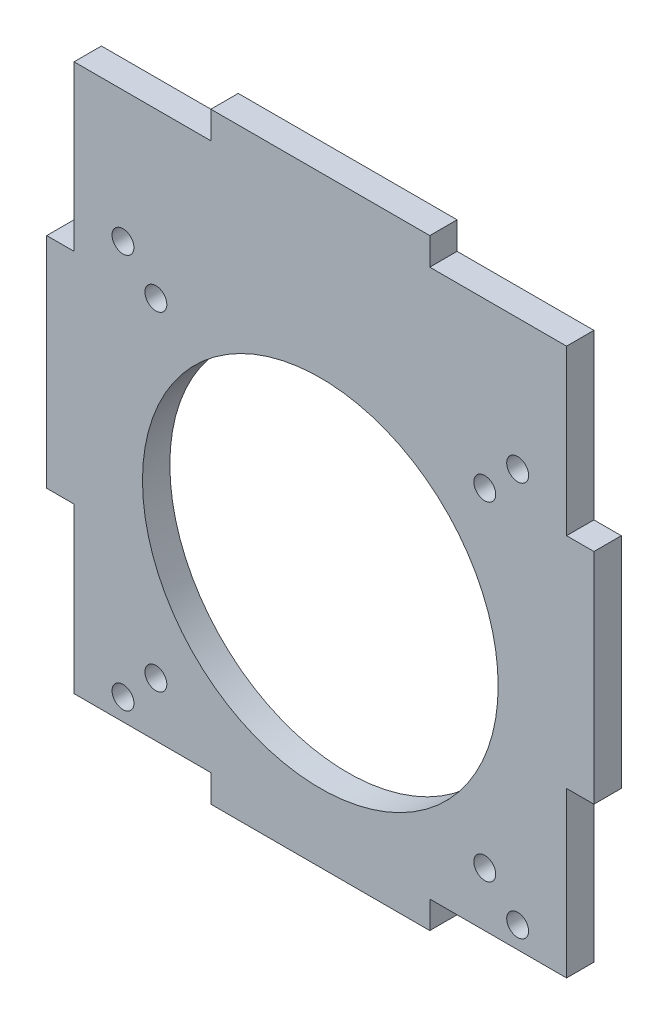
ISO-10303-21;
HEADER;
FILE_DESCRIPTION(('STEP AP214'),'2;1');
FILE_NAME('part.step','',(''),(''),'','','');
FILE_SCHEMA(('AUTOMOTIVE_DESIGN { 1 0 10303 214 1 1 1 1 }'));
ENDSEC;
DATA;
#1=APPLICATION_CONTEXT('core data for automotive mechanical design processes');
#2=APPLICATION_PROTOCOL_DEFINITION('international standard','automotive_design',2000,#1);
#3=PRODUCT_CONTEXT('',#1,'mechanical');
#4=PRODUCT('Part','Part','',(#3));
#5=PRODUCT_RELATED_PRODUCT_CATEGORY('part','',(#4));
#6=PRODUCT_DEFINITION_FORMATION('','',#4);
#7=PRODUCT_DEFINITION_CONTEXT('part definition',#1,'design');
#8=PRODUCT_DEFINITION('design','',#6,#7);
#9=PRODUCT_DEFINITION_SHAPE('','',#8);
#10=(LENGTH_UNIT() NAMED_UNIT(*) SI_UNIT(.MILLI.,.METRE.));
#11=(NAMED_UNIT(*) PLANE_ANGLE_UNIT() SI_UNIT($,.RADIAN.));
#12=(NAMED_UNIT(*) SI_UNIT($,.STERADIAN.) SOLID_ANGLE_UNIT());
#13=UNCERTAINTY_MEASURE_WITH_UNIT(LENGTH_MEASURE(1.E-05),#10,'distance_accuracy_value','');
#14=(GEOMETRIC_REPRESENTATION_CONTEXT(3) GLOBAL_UNCERTAINTY_ASSIGNED_CONTEXT((#13)) GLOBAL_UNIT_ASSIGNED_CONTEXT((#10,
#11,#12)) REPRESENTATION_CONTEXT('',''));
#15=CARTESIAN_POINT('',(0.,0.,0.));
#16=DIRECTION('',(0.,0.,1.));
#17=DIRECTION('',(1.,0.,0.));
#18=AXIS2_PLACEMENT_3D('',#15,#16,#17);
#19=CARTESIAN_POINT('',(0.,0.,5.));
#20=DIRECTION('',(0.,0.,-1.));
#21=DIRECTION('',(-1.,0.,0.));
#22=AXIS2_PLACEMENT_3D('',#19,#20,#21);
#23=PLANE('',#22);
#24=DIRECTION('',(-1.,0.,0.));
#25=VECTOR('',#24,1.);
#26=CARTESIAN_POINT('',(-20.,60.,5.));
#27=LINE('',#26,#25);
#28=CARTESIAN_POINT('',(-20.,60.,5.));
#29=VERTEX_POINT('',#28);
#30=CARTESIAN_POINT('',(-45.,60.,5.));
#31=VERTEX_POINT('',#30);
#32=EDGE_CURVE('E241',#29,#31,#27,.T.);
#33=ORIENTED_EDGE('',*,*,#32,.T.);
#34=DIRECTION('',(0.,-1.,0.));
#35=VECTOR('',#34,1.);
#36=CARTESIAN_POINT('',(-45.,30.,5.));
#37=LINE('',#36,#35);
#38=CARTESIAN_POINT('',(-45.,30.,5.));
#39=VERTEX_POINT('',#38);
#40=EDGE_CURVE('E129',#31,#39,#37,.T.);
#41=ORIENTED_EDGE('',*,*,#40,.T.);
#42=DIRECTION('',(-1.,0.,0.));
#43=VECTOR('',#42,1.);
#44=CARTESIAN_POINT('',(-50.,30.,5.));
#45=LINE('',#44,#43);
#46=CARTESIAN_POINT('',(-50.,30.,5.));
#47=VERTEX_POINT('',#46);
#48=EDGE_CURVE('E292',#39,#47,#45,.T.);
#49=ORIENTED_EDGE('',*,*,#48,.T.);
#50=DIRECTION('',(0.,-1.,0.));
#51=VECTOR('',#50,1.);
#52=CARTESIAN_POINT('',(-50.,-10.,5.));
#53=LINE('',#52,#51);
#54=CARTESIAN_POINT('',(-50.,-10.,5.));
#55=VERTEX_POINT('',#54);
#56=EDGE_CURVE('E311',#47,#55,#53,.T.);
#57=ORIENTED_EDGE('',*,*,#56,.T.);
#58=DIRECTION('',(1.,0.,0.));
#59=VECTOR('',#58,1.);
#60=CARTESIAN_POINT('',(-50.,-10.,5.));
#61=LINE('',#60,#59);
#62=CARTESIAN_POINT('',(-45.,-10.,5.));
#63=VERTEX_POINT('',#62);
#64=EDGE_CURVE('E308',#55,#63,#61,.T.);
#65=ORIENTED_EDGE('',*,*,#64,.T.);
#66=DIRECTION('',(0.,-1.,0.));
#67=VECTOR('',#66,1.);
#68=CARTESIAN_POINT('',(-45.,-40.,5.));
#69=LINE('',#68,#67);
#70=CARTESIAN_POINT('',(-45.,-40.,5.));
#71=VERTEX_POINT('',#70);
#72=EDGE_CURVE('E310',#63,#71,#69,.T.);
#73=ORIENTED_EDGE('',*,*,#72,.T.);
#74=DIRECTION('',(1.,0.,0.));
#75=VECTOR('',#74,1.);
#76=CARTESIAN_POINT('',(-20.,-40.,5.));
#77=LINE('',#76,#75);
#78=CARTESIAN_POINT('',(-20.,-40.,5.));
#79=VERTEX_POINT('',#78);
#80=EDGE_CURVE('E313',#71,#79,#77,.T.);
#81=ORIENTED_EDGE('',*,*,#80,.T.);
#82=DIRECTION('',(0.,-1.,0.));
#83=VECTOR('',#82,1.);
#84=CARTESIAN_POINT('',(-20.,-40.,5.));
#85=LINE('',#84,#83);
#86=CARTESIAN_POINT('',(-20.,-45.,5.));
#87=VERTEX_POINT('',#86);
#88=EDGE_CURVE('E319',#79,#87,#85,.T.);
#89=ORIENTED_EDGE('',*,*,#88,.T.);
#90=DIRECTION('',(1.,0.,0.));
#91=VECTOR('',#90,1.);
#92=CARTESIAN_POINT('',(20.,-45.,5.));
#93=LINE('',#92,#91);
#94=CARTESIAN_POINT('',(20.,-45.,5.));
#95=VERTEX_POINT('',#94);
#96=EDGE_CURVE('E321',#87,#95,#93,.T.);
#97=ORIENTED_EDGE('',*,*,#96,.T.);
#98=DIRECTION('',(0.,1.,0.));
#99=VECTOR('',#98,1.);
#100=CARTESIAN_POINT('',(20.,-40.,5.));
#101=LINE('',#100,#99);
#102=CARTESIAN_POINT('',(20.,-40.,5.));
#103=VERTEX_POINT('',#102);
#104=EDGE_CURVE('E323',#95,#103,#101,.T.);
#105=ORIENTED_EDGE('',*,*,#104,.T.);
#106=DIRECTION('',(1.,0.,0.));
#107=VECTOR('',#106,1.);
#108=CARTESIAN_POINT('',(45.,-40.,5.));
#109=LINE('',#108,#107);
#110=CARTESIAN_POINT('',(45.,-40.,5.));
#111=VERTEX_POINT('',#110);
#112=EDGE_CURVE('E325',#103,#111,#109,.T.);
#113=ORIENTED_EDGE('',*,*,#112,.T.);
#114=DIRECTION('',(0.,1.,0.));
#115=VECTOR('',#114,1.);
#116=CARTESIAN_POINT('',(45.,-40.,5.));
#117=LINE('',#116,#115);
#118=CARTESIAN_POINT('',(45.,-10.,5.));
#119=VERTEX_POINT('',#118);
#120=EDGE_CURVE('E327',#111,#119,#117,.T.);
#121=ORIENTED_EDGE('',*,*,#120,.T.);
#122=DIRECTION('',(1.,0.,0.));
#123=VECTOR('',#122,1.);
#124=CARTESIAN_POINT('',(45.,-10.,5.));
#125=LINE('',#124,#123);
#126=CARTESIAN_POINT('',(50.,-10.,5.));
#127=VERTEX_POINT('',#126);
#128=EDGE_CURVE('E329',#119,#127,#125,.T.);
#129=ORIENTED_EDGE('',*,*,#128,.T.);
#130=DIRECTION('',(0.,1.,0.));
#131=VECTOR('',#130,1.);
#132=CARTESIAN_POINT('',(50.,-10.,5.));
#133=LINE('',#132,#131);
#134=CARTESIAN_POINT('',(50.,30.,5.));
#135=VERTEX_POINT('',#134);
#136=EDGE_CURVE('E331',#127,#135,#133,.T.);
#137=ORIENTED_EDGE('',*,*,#136,.T.);
#138=DIRECTION('',(-1.,0.,0.));
#139=VECTOR('',#138,1.);
#140=CARTESIAN_POINT('',(45.,30.,5.));
#141=LINE('',#140,#139);
#142=CARTESIAN_POINT('',(45.,30.,5.));
#143=VERTEX_POINT('',#142);
#144=EDGE_CURVE('E333',#135,#143,#141,.T.);
#145=ORIENTED_EDGE('',*,*,#144,.T.);
#146=DIRECTION('',(0.,1.,0.));
#147=VECTOR('',#146,1.);
#148=CARTESIAN_POINT('',(45.,30.,5.));
#149=LINE('',#148,#147);
#150=CARTESIAN_POINT('',(45.,60.,5.));
#151=VERTEX_POINT('',#150);
#152=EDGE_CURVE('E335',#143,#151,#149,.T.);
#153=ORIENTED_EDGE('',*,*,#152,.T.);
#154=DIRECTION('',(-1.,0.,0.));
#155=VECTOR('',#154,1.);
#156=CARTESIAN_POINT('',(45.,60.,5.));
#157=LINE('',#156,#155);
#158=CARTESIAN_POINT('',(20.,60.,5.));
#159=VERTEX_POINT('',#158);
#160=EDGE_CURVE('E184',#151,#159,#157,.T.);
#161=ORIENTED_EDGE('',*,*,#160,.T.);
#162=DIRECTION('',(0.,1.,0.));
#163=VECTOR('',#162,1.);
#164=CARTESIAN_POINT('',(20.,65.,5.));
#165=LINE('',#164,#163);
#166=CARTESIAN_POINT('',(20.,65.,5.));
#167=VERTEX_POINT('',#166);
#168=EDGE_CURVE('E178',#159,#167,#165,.T.);
#169=ORIENTED_EDGE('',*,*,#168,.T.);
#170=DIRECTION('',(-1.,0.,0.));
#171=VECTOR('',#170,1.);
#172=CARTESIAN_POINT('',(20.,65.,5.));
#173=LINE('',#172,#171);
#174=CARTESIAN_POINT('',(-20.,65.,5.));
#175=VERTEX_POINT('',#174);
#176=EDGE_CURVE('E182',#167,#175,#173,.T.);
#177=ORIENTED_EDGE('',*,*,#176,.T.);
#178=DIRECTION('',(0.,-1.,0.));
#179=VECTOR('',#178,1.);
#180=CARTESIAN_POINT('',(-20.,65.,5.));
#181=LINE('',#180,#179);
#182=EDGE_CURVE('E50',#175,#29,#181,.T.);
#183=ORIENTED_EDGE('',*,*,#182,.T.);
#184=EDGE_LOOP('',(#33,#41,#49,#57,#65,#73,#81,#89,#97,#105,#113,#121,#129,#137,#145,#153,#161,
#169,#177,#183));
#185=FACE_BOUND('',#184,.T.);
#186=CARTESIAN_POINT('',(-36.06,36.06,5.));
#187=DIRECTION('',(0.,0.,1.));
#188=DIRECTION('',(1.,0.,0.));
#189=AXIS2_PLACEMENT_3D('',#186,#187,#188);
#190=CIRCLE('',#189,2.);
#191=CARTESIAN_POINT('',(-34.06,36.06,5.));
#192=VERTEX_POINT('',#191);
#193=EDGE_CURVE('E206',#192,#192,#190,.T.);
#194=ORIENTED_EDGE('',*,*,#193,.F.);
#195=EDGE_LOOP('',(#194));
#196=FACE_BOUND('',#195,.T.);
#197=CARTESIAN_POINT('',(36.06,36.06,5.));
#198=DIRECTION('',(0.,0.,1.));
#199=DIRECTION('',(1.,0.,0.));
#200=AXIS2_PLACEMENT_3D('',#197,#198,#199);
#201=CIRCLE('',#200,2.);
#202=CARTESIAN_POINT('',(38.06,36.06,5.));
#203=VERTEX_POINT('',#202);
#204=EDGE_CURVE('E449',#203,#203,#201,.T.);
#205=ORIENTED_EDGE('',*,*,#204,.F.);
#206=EDGE_LOOP('',(#205));
#207=FACE_BOUND('',#206,.T.);
#208=CARTESIAN_POINT('',(36.0600000000007,-36.06,5.));
#209=DIRECTION('',(0.,0.,1.));
#210=DIRECTION('',(1.,0.,0.));
#211=AXIS2_PLACEMENT_3D('',#208,#209,#210);
#212=CIRCLE('',#211,2.);
#213=CARTESIAN_POINT('',(38.0600000000008,-36.06,5.));
#214=VERTEX_POINT('',#213);
#215=EDGE_CURVE('E443',#214,#214,#212,.T.);
#216=ORIENTED_EDGE('',*,*,#215,.F.);
#217=EDGE_LOOP('',(#216));
#218=FACE_BOUND('',#217,.T.);
#219=CARTESIAN_POINT('',(-36.0599999999992,-36.06,5.));
#220=DIRECTION('',(0.,0.,1.));
#221=DIRECTION('',(1.,0.,0.));
#222=AXIS2_PLACEMENT_3D('',#219,#220,#221);
#223=CIRCLE('',#222,2.);
#224=CARTESIAN_POINT('',(-34.0599999999992,-36.06,5.));
#225=VERTEX_POINT('',#224);
#226=EDGE_CURVE('E437',#225,#225,#223,.T.);
#227=ORIENTED_EDGE('',*,*,#226,.F.);
#228=EDGE_LOOP('',(#227));
#229=FACE_BOUND('',#228,.T.);
#230=CARTESIAN_POINT('',(0.,0.,5.));
#231=DIRECTION('',(0.,0.,1.));
#232=DIRECTION('',(1.,0.,0.));
#233=AXIS2_PLACEMENT_3D('',#230,#231,#232);
#234=CIRCLE('',#233,32.5);
#235=CARTESIAN_POINT('',(32.5,0.,5.));
#236=VERTEX_POINT('',#235);
#237=EDGE_CURVE('E431',#236,#236,#234,.T.);
#238=ORIENTED_EDGE('',*,*,#237,.F.);
#239=EDGE_LOOP('',(#238));
#240=FACE_BOUND('',#239,.T.);
#241=CARTESIAN_POINT('',(-30.0520382004283,30.0520382004283,5.));
#242=DIRECTION('',(0.,0.,1.));
#243=DIRECTION('',(1.,0.,0.));
#244=AXIS2_PLACEMENT_3D('',#241,#242,#243);
#245=CIRCLE('',#244,2.);
#246=CARTESIAN_POINT('',(-28.0520382004283,30.0520382004283,5.));
#247=VERTEX_POINT('',#246);
#248=EDGE_CURVE('E425',#247,#247,#245,.T.);
#249=ORIENTED_EDGE('',*,*,#248,.F.);
#250=EDGE_LOOP('',(#249));
#251=FACE_BOUND('',#250,.T.);
#252=CARTESIAN_POINT('',(30.0520382004284,30.0520382004282,5.));
#253=DIRECTION('',(0.,0.,1.));
#254=DIRECTION('',(1.,0.,0.));
#255=AXIS2_PLACEMENT_3D('',#252,#253,#254);
#256=CIRCLE('',#255,2.);
#257=CARTESIAN_POINT('',(32.0520382004284,30.0520382004282,5.));
#258=VERTEX_POINT('',#257);
#259=EDGE_CURVE('E419',#258,#258,#256,.T.);
#260=ORIENTED_EDGE('',*,*,#259,.F.);
#261=EDGE_LOOP('',(#260));
#262=FACE_BOUND('',#261,.T.);
#263=CARTESIAN_POINT('',(30.05203820043,-30.05203820043,5.));
#264=DIRECTION('',(0.,0.,1.));
#265=DIRECTION('',(1.,0.,0.));
#266=AXIS2_PLACEMENT_3D('',#263,#264,#265);
#267=CIRCLE('',#266,2.00000000000139);
#268=CARTESIAN_POINT('',(32.0520382004314,-30.05203820043,5.));
#269=VERTEX_POINT('',#268);
#270=EDGE_CURVE('E413',#269,#269,#267,.T.);
#271=ORIENTED_EDGE('',*,*,#270,.F.);
#272=EDGE_LOOP('',(#271));
#273=FACE_BOUND('',#272,.T.);
#274=CARTESIAN_POINT('',(-30.0520382004283,-30.05203820043,5.));
#275=DIRECTION('',(0.,0.,1.));
#276=DIRECTION('',(1.,0.,0.));
#277=AXIS2_PLACEMENT_3D('',#274,#275,#276);
#278=CIRCLE('',#277,2.00000000000203);
#279=CARTESIAN_POINT('',(-28.0520382004262,-30.05203820043,5.));
#280=VERTEX_POINT('',#279);
#281=EDGE_CURVE('E404',#280,#280,#278,.T.);
#282=ORIENTED_EDGE('',*,*,#281,.F.);
#283=EDGE_LOOP('',(#282));
#284=FACE_BOUND('',#283,.T.);
#285=ADVANCED_FACE('F33',(#185,#196,#207,#218,#229,#240,#251,#262,#273,#284),#23,.F.);
#286=CARTESIAN_POINT('',(0.,0.,0.));
#287=DIRECTION('',(0.,0.,-1.));
#288=DIRECTION('',(-1.,0.,0.));
#289=AXIS2_PLACEMENT_3D('',#286,#287,#288);
#290=PLANE('',#289);
#291=CARTESIAN_POINT('',(30.05203820043,-30.05203820043,0.));
#292=DIRECTION('',(0.,0.,1.));
#293=DIRECTION('',(1.,0.,0.));
#294=AXIS2_PLACEMENT_3D('',#291,#292,#293);
#295=CIRCLE('',#294,2.00000000000139);
#296=CARTESIAN_POINT('',(32.0520382004314,-30.05203820043,0.));
#297=VERTEX_POINT('',#296);
#298=EDGE_CURVE('E410',#297,#297,#295,.T.);
#299=ORIENTED_EDGE('',*,*,#298,.T.);
#300=EDGE_LOOP('',(#299));
#301=FACE_BOUND('',#300,.T.);
#302=CARTESIAN_POINT('',(-30.0520382004283,30.0520382004283,0.));
#303=DIRECTION('',(0.,0.,1.));
#304=DIRECTION('',(1.,0.,0.));
#305=AXIS2_PLACEMENT_3D('',#302,#303,#304);
#306=CIRCLE('',#305,2.);
#307=CARTESIAN_POINT('',(-28.0520382004283,30.0520382004283,0.));
#308=VERTEX_POINT('',#307);
#309=EDGE_CURVE('E422',#308,#308,#306,.T.);
#310=ORIENTED_EDGE('',*,*,#309,.T.);
#311=EDGE_LOOP('',(#310));
#312=FACE_BOUND('',#311,.T.);
#313=CARTESIAN_POINT('',(-36.0599999999992,-36.06,0.));
#314=DIRECTION('',(0.,0.,1.));
#315=DIRECTION('',(1.,0.,0.));
#316=AXIS2_PLACEMENT_3D('',#313,#314,#315);
#317=CIRCLE('',#316,2.);
#318=CARTESIAN_POINT('',(-34.0599999999992,-36.06,0.));
#319=VERTEX_POINT('',#318);
#320=EDGE_CURVE('E434',#319,#319,#317,.T.);
#321=ORIENTED_EDGE('',*,*,#320,.T.);
#322=EDGE_LOOP('',(#321));
#323=FACE_BOUND('',#322,.T.);
#324=CARTESIAN_POINT('',(36.06,36.06,0.));
#325=DIRECTION('',(0.,0.,1.));
#326=DIRECTION('',(1.,0.,0.));
#327=AXIS2_PLACEMENT_3D('',#324,#325,#326);
#328=CIRCLE('',#327,2.);
#329=CARTESIAN_POINT('',(38.06,36.06,0.));
#330=VERTEX_POINT('',#329);
#331=EDGE_CURVE('E446',#330,#330,#328,.T.);
#332=ORIENTED_EDGE('',*,*,#331,.T.);
#333=EDGE_LOOP('',(#332));
#334=FACE_BOUND('',#333,.T.);
#335=DIRECTION('',(-1.,0.,0.));
#336=VECTOR('',#335,1.);
#337=CARTESIAN_POINT('',(-20.,60.,0.));
#338=LINE('',#337,#336);
#339=CARTESIAN_POINT('',(-20.,60.,0.));
#340=VERTEX_POINT('',#339);
#341=CARTESIAN_POINT('',(-45.,60.,0.));
#342=VERTEX_POINT('',#341);
#343=EDGE_CURVE('E202',#340,#342,#338,.T.);
#344=ORIENTED_EDGE('',*,*,#343,.F.);
#345=DIRECTION('',(0.,-1.,0.));
#346=VECTOR('',#345,1.);
#347=CARTESIAN_POINT('',(-20.,65.,0.));
#348=LINE('',#347,#346);
#349=CARTESIAN_POINT('',(-20.,65.,0.));
#350=VERTEX_POINT('',#349);
#351=EDGE_CURVE('E121',#350,#340,#348,.T.);
#352=ORIENTED_EDGE('',*,*,#351,.F.);
#353=DIRECTION('',(-1.,0.,0.));
#354=VECTOR('',#353,1.);
#355=CARTESIAN_POINT('',(20.,65.,0.));
#356=LINE('',#355,#354);
#357=CARTESIAN_POINT('',(20.,65.,0.));
#358=VERTEX_POINT('',#357);
#359=EDGE_CURVE('E115',#358,#350,#356,.T.);
#360=ORIENTED_EDGE('',*,*,#359,.F.);
#361=DIRECTION('',(0.,1.,0.));
#362=VECTOR('',#361,1.);
#363=CARTESIAN_POINT('',(20.,65.,0.));
#364=LINE('',#363,#362);
#365=CARTESIAN_POINT('',(20.,60.,0.));
#366=VERTEX_POINT('',#365);
#367=EDGE_CURVE('E192',#366,#358,#364,.T.);
#368=ORIENTED_EDGE('',*,*,#367,.F.);
#369=DIRECTION('',(-1.,0.,0.));
#370=VECTOR('',#369,1.);
#371=CARTESIAN_POINT('',(45.,60.,0.));
#372=LINE('',#371,#370);
#373=CARTESIAN_POINT('',(45.,60.,0.));
#374=VERTEX_POINT('',#373);
#375=EDGE_CURVE('E236',#374,#366,#372,.T.);
#376=ORIENTED_EDGE('',*,*,#375,.F.);
#377=DIRECTION('',(0.,1.,0.));
#378=VECTOR('',#377,1.);
#379=CARTESIAN_POINT('',(45.,30.,0.));
#380=LINE('',#379,#378);
#381=CARTESIAN_POINT('',(45.,30.,0.));
#382=VERTEX_POINT('',#381);
#383=EDGE_CURVE('E234',#382,#374,#380,.T.);
#384=ORIENTED_EDGE('',*,*,#383,.F.);
#385=DIRECTION('',(-1.,0.,0.));
#386=VECTOR('',#385,1.);
#387=CARTESIAN_POINT('',(45.,30.,0.));
#388=LINE('',#387,#386);
#389=CARTESIAN_POINT('',(50.,30.,0.));
#390=VERTEX_POINT('',#389);
#391=EDGE_CURVE('E232',#390,#382,#388,.T.);
#392=ORIENTED_EDGE('',*,*,#391,.F.);
#393=DIRECTION('',(0.,1.,0.));
#394=VECTOR('',#393,1.);
#395=CARTESIAN_POINT('',(50.,-10.,0.));
#396=LINE('',#395,#394);
#397=CARTESIAN_POINT('',(50.,-10.,0.));
#398=VERTEX_POINT('',#397);
#399=EDGE_CURVE('E230',#398,#390,#396,.T.);
#400=ORIENTED_EDGE('',*,*,#399,.F.);
#401=DIRECTION('',(1.,0.,0.));
#402=VECTOR('',#401,1.);
#403=CARTESIAN_POINT('',(45.,-10.,0.));
#404=LINE('',#403,#402);
#405=CARTESIAN_POINT('',(45.,-10.,0.));
#406=VERTEX_POINT('',#405);
#407=EDGE_CURVE('E228',#406,#398,#404,.T.);
#408=ORIENTED_EDGE('',*,*,#407,.F.);
#409=DIRECTION('',(0.,1.,0.));
#410=VECTOR('',#409,1.);
#411=CARTESIAN_POINT('',(45.,-40.,0.));
#412=LINE('',#411,#410);
#413=CARTESIAN_POINT('',(45.,-40.,0.));
#414=VERTEX_POINT('',#413);
#415=EDGE_CURVE('E226',#414,#406,#412,.T.);
#416=ORIENTED_EDGE('',*,*,#415,.F.);
#417=DIRECTION('',(1.,0.,0.));
#418=VECTOR('',#417,1.);
#419=CARTESIAN_POINT('',(45.,-40.,0.));
#420=LINE('',#419,#418);
#421=CARTESIAN_POINT('',(20.,-40.,0.));
#422=VERTEX_POINT('',#421);
#423=EDGE_CURVE('E224',#422,#414,#420,.T.);
#424=ORIENTED_EDGE('',*,*,#423,.F.);
#425=DIRECTION('',(0.,1.,0.));
#426=VECTOR('',#425,1.);
#427=CARTESIAN_POINT('',(20.,-40.,0.));
#428=LINE('',#427,#426);
#429=CARTESIAN_POINT('',(20.,-45.,0.));
#430=VERTEX_POINT('',#429);
#431=EDGE_CURVE('E222',#430,#422,#428,.T.);
#432=ORIENTED_EDGE('',*,*,#431,.F.);
#433=DIRECTION('',(1.,0.,0.));
#434=VECTOR('',#433,1.);
#435=CARTESIAN_POINT('',(20.,-45.,0.));
#436=LINE('',#435,#434);
#437=CARTESIAN_POINT('',(-20.,-45.,0.));
#438=VERTEX_POINT('',#437);
#439=EDGE_CURVE('E220',#438,#430,#436,.T.);
#440=ORIENTED_EDGE('',*,*,#439,.F.);
#441=DIRECTION('',(0.,-1.,0.));
#442=VECTOR('',#441,1.);
#443=CARTESIAN_POINT('',(-20.,-40.,0.));
#444=LINE('',#443,#442);
#445=CARTESIAN_POINT('',(-20.,-40.,0.));
#446=VERTEX_POINT('',#445);
#447=EDGE_CURVE('E218',#446,#438,#444,.T.);
#448=ORIENTED_EDGE('',*,*,#447,.F.);
#449=DIRECTION('',(1.,0.,0.));
#450=VECTOR('',#449,1.);
#451=CARTESIAN_POINT('',(-20.,-40.,0.));
#452=LINE('',#451,#450);
#453=CARTESIAN_POINT('',(-45.,-40.,0.));
#454=VERTEX_POINT('',#453);
#455=EDGE_CURVE('E216',#454,#446,#452,.T.);
#456=ORIENTED_EDGE('',*,*,#455,.F.);
#457=DIRECTION('',(0.,-1.,0.));
#458=VECTOR('',#457,1.);
#459=CARTESIAN_POINT('',(-45.,-40.,0.));
#460=LINE('',#459,#458);
#461=CARTESIAN_POINT('',(-45.,-10.,0.));
#462=VERTEX_POINT('',#461);
#463=EDGE_CURVE('E214',#462,#454,#460,.T.);
#464=ORIENTED_EDGE('',*,*,#463,.F.);
#465=DIRECTION('',(1.,0.,0.));
#466=VECTOR('',#465,1.);
#467=CARTESIAN_POINT('',(-50.,-10.,0.));
#468=LINE('',#467,#466);
#469=CARTESIAN_POINT('',(-50.,-10.,0.));
#470=VERTEX_POINT('',#469);
#471=EDGE_CURVE('E212',#470,#462,#468,.T.);
#472=ORIENTED_EDGE('',*,*,#471,.F.);
#473=DIRECTION('',(0.,-1.,0.));
#474=VECTOR('',#473,1.);
#475=CARTESIAN_POINT('',(-50.,-10.,0.));
#476=LINE('',#475,#474);
#477=CARTESIAN_POINT('',(-50.,30.,0.));
#478=VERTEX_POINT('',#477);
#479=EDGE_CURVE('E210',#478,#470,#476,.T.);
#480=ORIENTED_EDGE('',*,*,#479,.F.);
#481=DIRECTION('',(-1.,0.,0.));
#482=VECTOR('',#481,1.);
#483=CARTESIAN_POINT('',(-50.,30.,0.));
#484=LINE('',#483,#482);
#485=CARTESIAN_POINT('',(-45.,30.,0.));
#486=VERTEX_POINT('',#485);
#487=EDGE_CURVE('E208',#486,#478,#484,.T.);
#488=ORIENTED_EDGE('',*,*,#487,.F.);
#489=DIRECTION('',(0.,-1.,0.));
#490=VECTOR('',#489,1.);
#491=CARTESIAN_POINT('',(-45.,30.,0.));
#492=LINE('',#491,#490);
#493=EDGE_CURVE('E205',#342,#486,#492,.T.);
#494=ORIENTED_EDGE('',*,*,#493,.F.);
#495=EDGE_LOOP('',(#344,#352,#360,#368,#376,#384,#392,#400,#408,#416,#424,#432,#440,#448,#456,
#464,#472,#480,#488,#494));
#496=FACE_BOUND('',#495,.T.);
#497=CARTESIAN_POINT('',(-36.06,36.06,0.));
#498=DIRECTION('',(0.,0.,1.));
#499=DIRECTION('',(1.,0.,0.));
#500=AXIS2_PLACEMENT_3D('',#497,#498,#499);
#501=CIRCLE('',#500,2.);
#502=CARTESIAN_POINT('',(-34.06,36.06,0.));
#503=VERTEX_POINT('',#502);
#504=EDGE_CURVE('E452',#503,#503,#501,.T.);
#505=ORIENTED_EDGE('',*,*,#504,.T.);
#506=EDGE_LOOP('',(#505));
#507=FACE_BOUND('',#506,.T.);
#508=CARTESIAN_POINT('',(36.0600000000007,-36.06,0.));
#509=DIRECTION('',(0.,0.,1.));
#510=DIRECTION('',(1.,0.,0.));
#511=AXIS2_PLACEMENT_3D('',#508,#509,#510);
#512=CIRCLE('',#511,2.);
#513=CARTESIAN_POINT('',(38.0600000000008,-36.06,0.));
#514=VERTEX_POINT('',#513);
#515=EDGE_CURVE('E440',#514,#514,#512,.T.);
#516=ORIENTED_EDGE('',*,*,#515,.T.);
#517=EDGE_LOOP('',(#516));
#518=FACE_BOUND('',#517,.T.);
#519=CARTESIAN_POINT('',(0.,0.,0.));
#520=DIRECTION('',(0.,0.,1.));
#521=DIRECTION('',(1.,0.,0.));
#522=AXIS2_PLACEMENT_3D('',#519,#520,#521);
#523=CIRCLE('',#522,32.5);
#524=CARTESIAN_POINT('',(32.5,0.,0.));
#525=VERTEX_POINT('',#524);
#526=EDGE_CURVE('E428',#525,#525,#523,.T.);
#527=ORIENTED_EDGE('',*,*,#526,.T.);
#528=EDGE_LOOP('',(#527));
#529=FACE_BOUND('',#528,.T.);
#530=CARTESIAN_POINT('',(30.0520382004284,30.0520382004282,0.));
#531=DIRECTION('',(0.,0.,1.));
#532=DIRECTION('',(1.,0.,0.));
#533=AXIS2_PLACEMENT_3D('',#530,#531,#532);
#534=CIRCLE('',#533,2.);
#535=CARTESIAN_POINT('',(32.0520382004284,30.0520382004282,0.));
#536=VERTEX_POINT('',#535);
#537=EDGE_CURVE('E416',#536,#536,#534,.T.);
#538=ORIENTED_EDGE('',*,*,#537,.T.);
#539=EDGE_LOOP('',(#538));
#540=FACE_BOUND('',#539,.T.);
#541=CARTESIAN_POINT('',(-30.0520382004283,-30.05203820043,0.));
#542=DIRECTION('',(0.,0.,1.));
#543=DIRECTION('',(1.,0.,0.));
#544=AXIS2_PLACEMENT_3D('',#541,#542,#543);
#545=CIRCLE('',#544,2.00000000000203);
#546=CARTESIAN_POINT('',(-28.0520382004262,-30.05203820043,0.));
#547=VERTEX_POINT('',#546);
#548=EDGE_CURVE('E407',#547,#547,#545,.T.);
#549=ORIENTED_EDGE('',*,*,#548,.T.);
#550=EDGE_LOOP('',(#549));
#551=FACE_BOUND('',#550,.T.);
#552=ADVANCED_FACE('F296',(#301,#312,#323,#334,#496,#507,#518,#529,#540,#551),#290,.T.);
#553=CARTESIAN_POINT('',(-20.,60.,5.));
#554=DIRECTION('',(0.,-1.,0.));
#555=DIRECTION('',(1.,0.,0.));
#556=AXIS2_PLACEMENT_3D('',#553,#554,#555);
#557=PLANE('',#556);
#558=ORIENTED_EDGE('',*,*,#343,.T.);
#559=DIRECTION('',(0.,0.,-1.));
#560=VECTOR('',#559,1.);
#561=CARTESIAN_POINT('',(-45.,60.,5.));
#562=LINE('',#561,#560);
#563=EDGE_CURVE('E11',#31,#342,#562,.T.);
#564=ORIENTED_EDGE('',*,*,#563,.F.);
#565=ORIENTED_EDGE('',*,*,#32,.F.);
#566=DIRECTION('',(0.,0.,-1.));
#567=VECTOR('',#566,1.);
#568=CARTESIAN_POINT('',(-20.,60.,5.));
#569=LINE('',#568,#567);
#570=EDGE_CURVE('E198',#29,#340,#569,.T.);
#571=ORIENTED_EDGE('',*,*,#570,.T.);
#572=EDGE_LOOP('',(#558,#564,#565,#571));
#573=FACE_BOUND('',#572,.T.);
#574=ADVANCED_FACE('F35',(#573),#557,.F.);
#575=CARTESIAN_POINT('',(-45.,30.,5.));
#576=DIRECTION('',(1.,0.,0.));
#577=DIRECTION('',(0.,0.,-1.));
#578=AXIS2_PLACEMENT_3D('',#575,#576,#577);
#579=PLANE('',#578);
#580=ORIENTED_EDGE('',*,*,#493,.T.);
#581=DIRECTION('',(0.,0.,-1.));
#582=VECTOR('',#581,1.);
#583=CARTESIAN_POINT('',(-45.,30.,5.));
#584=LINE('',#583,#582);
#585=EDGE_CURVE('E42',#39,#486,#584,.T.);
#586=ORIENTED_EDGE('',*,*,#585,.F.);
#587=ORIENTED_EDGE('',*,*,#40,.F.);
#588=ORIENTED_EDGE('',*,*,#563,.T.);
#589=EDGE_LOOP('',(#580,#586,#587,#588));
#590=FACE_BOUND('',#589,.T.);
#591=ADVANCED_FACE('F689',(#590),#579,.F.);
#592=CARTESIAN_POINT('',(-50.,30.,5.));
#593=DIRECTION('',(0.,-1.,0.));
#594=DIRECTION('',(1.,0.,0.));
#595=AXIS2_PLACEMENT_3D('',#592,#593,#594);
#596=PLANE('',#595);
#597=ORIENTED_EDGE('',*,*,#487,.T.);
#598=DIRECTION('',(0.,0.,-1.));
#599=VECTOR('',#598,1.);
#600=CARTESIAN_POINT('',(-50.,30.,5.));
#601=LINE('',#600,#599);
#602=EDGE_CURVE('E284',#47,#478,#601,.T.);
#603=ORIENTED_EDGE('',*,*,#602,.F.);
#604=ORIENTED_EDGE('',*,*,#48,.F.);
#605=ORIENTED_EDGE('',*,*,#585,.T.);
#606=EDGE_LOOP('',(#597,#603,#604,#605));
#607=FACE_BOUND('',#606,.T.);
#608=ADVANCED_FACE('F290',(#607),#596,.F.);
#609=CARTESIAN_POINT('',(-50.,-10.,5.));
#610=DIRECTION('',(1.,0.,0.));
#611=DIRECTION('',(0.,1.,0.));
#612=AXIS2_PLACEMENT_3D('',#609,#610,#611);
#613=PLANE('',#612);
#614=ORIENTED_EDGE('',*,*,#479,.T.);
#615=DIRECTION('',(0.,0.,-1.));
#616=VECTOR('',#615,1.);
#617=CARTESIAN_POINT('',(-50.,-10.,5.));
#618=LINE('',#617,#616);
#619=EDGE_CURVE('E281',#55,#470,#618,.T.);
#620=ORIENTED_EDGE('',*,*,#619,.F.);
#621=ORIENTED_EDGE('',*,*,#56,.F.);
#622=ORIENTED_EDGE('',*,*,#602,.T.);
#623=EDGE_LOOP('',(#614,#620,#621,#622));
#624=FACE_BOUND('',#623,.T.);
#625=ADVANCED_FACE('F302',(#624),#613,.F.);
#626=CARTESIAN_POINT('',(-50.,-10.,5.));
#627=DIRECTION('',(0.,1.,0.));
#628=DIRECTION('',(-1.,0.,0.));
#629=AXIS2_PLACEMENT_3D('',#626,#627,#628);
#630=PLANE('',#629);
#631=ORIENTED_EDGE('',*,*,#471,.T.);
#632=DIRECTION('',(0.,0.,-1.));
#633=VECTOR('',#632,1.);
#634=CARTESIAN_POINT('',(-45.,-10.,5.));
#635=LINE('',#634,#633);
#636=EDGE_CURVE('E278',#63,#462,#635,.T.);
#637=ORIENTED_EDGE('',*,*,#636,.F.);
#638=ORIENTED_EDGE('',*,*,#64,.F.);
#639=ORIENTED_EDGE('',*,*,#619,.T.);
#640=EDGE_LOOP('',(#631,#637,#638,#639));
#641=FACE_BOUND('',#640,.T.);
#642=ADVANCED_FACE('F306',(#641),#630,.F.);
#643=CARTESIAN_POINT('',(-45.,-40.,5.));
#644=DIRECTION('',(1.,0.,0.));
#645=DIRECTION('',(0.,0.,-1.));
#646=AXIS2_PLACEMENT_3D('',#643,#644,#645);
#647=PLANE('',#646);
#648=ORIENTED_EDGE('',*,*,#463,.T.);
#649=DIRECTION('',(0.,0.,-1.));
#650=VECTOR('',#649,1.);
#651=CARTESIAN_POINT('',(-45.,-40.,5.));
#652=LINE('',#651,#650);
#653=EDGE_CURVE('E275',#71,#454,#652,.T.);
#654=ORIENTED_EDGE('',*,*,#653,.F.);
#655=ORIENTED_EDGE('',*,*,#72,.F.);
#656=ORIENTED_EDGE('',*,*,#636,.T.);
#657=EDGE_LOOP('',(#648,#654,#655,#656));
#658=FACE_BOUND('',#657,.T.);
#659=ADVANCED_FACE('F654',(#658),#647,.F.);
#660=CARTESIAN_POINT('',(-20.,-40.,5.));
#661=DIRECTION('',(0.,1.,0.));
#662=DIRECTION('',(-1.,0.,0.));
#663=AXIS2_PLACEMENT_3D('',#660,#661,#662);
#664=PLANE('',#663);
#665=ORIENTED_EDGE('',*,*,#455,.T.);
#666=DIRECTION('',(0.,0.,-1.));
#667=VECTOR('',#666,1.);
#668=CARTESIAN_POINT('',(-20.,-40.,5.));
#669=LINE('',#668,#667);
#670=EDGE_CURVE('E272',#79,#446,#669,.T.);
#671=ORIENTED_EDGE('',*,*,#670,.F.);
#672=ORIENTED_EDGE('',*,*,#80,.F.);
#673=ORIENTED_EDGE('',*,*,#653,.T.);
#674=EDGE_LOOP('',(#665,#671,#672,#673));
#675=FACE_BOUND('',#674,.T.);
#676=ADVANCED_FACE('F644',(#675),#664,.F.);
#677=CARTESIAN_POINT('',(-20.,-40.,5.));
#678=DIRECTION('',(1.,0.,0.));
#679=DIRECTION('',(0.,1.,0.));
#680=AXIS2_PLACEMENT_3D('',#677,#678,#679);
#681=PLANE('',#680);
#682=ORIENTED_EDGE('',*,*,#447,.T.);
#683=DIRECTION('',(0.,0.,-1.));
#684=VECTOR('',#683,1.);
#685=CARTESIAN_POINT('',(-20.,-45.,5.));
#686=LINE('',#685,#684);
#687=EDGE_CURVE('E269',#87,#438,#686,.T.);
#688=ORIENTED_EDGE('',*,*,#687,.F.);
#689=ORIENTED_EDGE('',*,*,#88,.F.);
#690=ORIENTED_EDGE('',*,*,#670,.T.);
#691=EDGE_LOOP('',(#682,#688,#689,#690));
#692=FACE_BOUND('',#691,.T.);
#693=ADVANCED_FACE('F634',(#692),#681,.F.);
#694=CARTESIAN_POINT('',(20.,-45.,5.));
#695=DIRECTION('',(0.,1.,0.));
#696=DIRECTION('',(-1.,0.,0.));
#697=AXIS2_PLACEMENT_3D('',#694,#695,#696);
#698=PLANE('',#697);
#699=ORIENTED_EDGE('',*,*,#439,.T.);
#700=DIRECTION('',(0.,0.,-1.));
#701=VECTOR('',#700,1.);
#702=CARTESIAN_POINT('',(20.,-45.,5.));
#703=LINE('',#702,#701);
#704=EDGE_CURVE('E266',#95,#430,#703,.T.);
#705=ORIENTED_EDGE('',*,*,#704,.F.);
#706=ORIENTED_EDGE('',*,*,#96,.F.);
#707=ORIENTED_EDGE('',*,*,#687,.T.);
#708=EDGE_LOOP('',(#699,#705,#706,#707));
#709=FACE_BOUND('',#708,.T.);
#710=ADVANCED_FACE('F624',(#709),#698,.F.);
#711=CARTESIAN_POINT('',(20.,-40.,5.));
#712=DIRECTION('',(-1.,0.,0.));
#713=DIRECTION('',(0.,0.,1.));
#714=AXIS2_PLACEMENT_3D('',#711,#712,#713);
#715=PLANE('',#714);
#716=ORIENTED_EDGE('',*,*,#431,.T.);
#717=DIRECTION('',(0.,0.,-1.));
#718=VECTOR('',#717,1.);
#719=CARTESIAN_POINT('',(20.,-40.,5.));
#720=LINE('',#719,#718);
#721=EDGE_CURVE('E263',#103,#422,#720,.T.);
#722=ORIENTED_EDGE('',*,*,#721,.F.);
#723=ORIENTED_EDGE('',*,*,#104,.F.);
#724=ORIENTED_EDGE('',*,*,#704,.T.);
#725=EDGE_LOOP('',(#716,#722,#723,#724));
#726=FACE_BOUND('',#725,.T.);
#727=ADVANCED_FACE('F614',(#726),#715,.F.);
#728=CARTESIAN_POINT('',(45.,-40.,5.));
#729=DIRECTION('',(0.,1.,0.));
#730=DIRECTION('',(0.,0.,1.));
#731=AXIS2_PLACEMENT_3D('',#728,#729,#730);
#732=PLANE('',#731);
#733=ORIENTED_EDGE('',*,*,#423,.T.);
#734=DIRECTION('',(0.,0.,-1.));
#735=VECTOR('',#734,1.);
#736=CARTESIAN_POINT('',(45.,-40.,5.));
#737=LINE('',#736,#735);
#738=EDGE_CURVE('E260',#111,#414,#737,.T.);
#739=ORIENTED_EDGE('',*,*,#738,.F.);
#740=ORIENTED_EDGE('',*,*,#112,.F.);
#741=ORIENTED_EDGE('',*,*,#721,.T.);
#742=EDGE_LOOP('',(#733,#739,#740,#741));
#743=FACE_BOUND('',#742,.T.);
#744=ADVANCED_FACE('F604',(#743),#732,.F.);
#745=CARTESIAN_POINT('',(45.,-40.,5.));
#746=DIRECTION('',(-1.,0.,0.));
#747=DIRECTION('',(0.,0.,1.));
#748=AXIS2_PLACEMENT_3D('',#745,#746,#747);
#749=PLANE('',#748);
#750=ORIENTED_EDGE('',*,*,#415,.T.);
#751=DIRECTION('',(0.,0.,-1.));
#752=VECTOR('',#751,1.);
#753=CARTESIAN_POINT('',(45.,-10.,5.));
#754=LINE('',#753,#752);
#755=EDGE_CURVE('E257',#119,#406,#754,.T.);
#756=ORIENTED_EDGE('',*,*,#755,.F.);
#757=ORIENTED_EDGE('',*,*,#120,.F.);
#758=ORIENTED_EDGE('',*,*,#738,.T.);
#759=EDGE_LOOP('',(#750,#756,#757,#758));
#760=FACE_BOUND('',#759,.T.);
#761=ADVANCED_FACE('F594',(#760),#749,.F.);
#762=CARTESIAN_POINT('',(45.,-10.,5.));
#763=DIRECTION('',(0.,1.,0.));
#764=DIRECTION('',(-1.,0.,0.));
#765=AXIS2_PLACEMENT_3D('',#762,#763,#764);
#766=PLANE('',#765);
#767=ORIENTED_EDGE('',*,*,#407,.T.);
#768=DIRECTION('',(0.,0.,-1.));
#769=VECTOR('',#768,1.);
#770=CARTESIAN_POINT('',(50.,-10.,5.));
#771=LINE('',#770,#769);
#772=EDGE_CURVE('E254',#127,#398,#771,.T.);
#773=ORIENTED_EDGE('',*,*,#772,.F.);
#774=ORIENTED_EDGE('',*,*,#128,.F.);
#775=ORIENTED_EDGE('',*,*,#755,.T.);
#776=EDGE_LOOP('',(#767,#773,#774,#775));
#777=FACE_BOUND('',#776,.T.);
#778=ADVANCED_FACE('F584',(#777),#766,.F.);
#779=CARTESIAN_POINT('',(50.,-10.,5.));
#780=DIRECTION('',(-1.,0.,0.));
#781=DIRECTION('',(0.,-1.,0.));
#782=AXIS2_PLACEMENT_3D('',#779,#780,#781);
#783=PLANE('',#782);
#784=ORIENTED_EDGE('',*,*,#399,.T.);
#785=DIRECTION('',(0.,0.,-1.));
#786=VECTOR('',#785,1.);
#787=CARTESIAN_POINT('',(50.,30.,5.));
#788=LINE('',#787,#786);
#789=EDGE_CURVE('E251',#135,#390,#788,.T.);
#790=ORIENTED_EDGE('',*,*,#789,.F.);
#791=ORIENTED_EDGE('',*,*,#136,.F.);
#792=ORIENTED_EDGE('',*,*,#772,.T.);
#793=EDGE_LOOP('',(#784,#790,#791,#792));
#794=FACE_BOUND('',#793,.T.);
#795=ADVANCED_FACE('F574',(#794),#783,.F.);
#796=CARTESIAN_POINT('',(45.,30.,5.));
#797=DIRECTION('',(0.,-1.,0.));
#798=DIRECTION('',(0.,0.,-1.));
#799=AXIS2_PLACEMENT_3D('',#796,#797,#798);
#800=PLANE('',#799);
#801=ORIENTED_EDGE('',*,*,#391,.T.);
#802=DIRECTION('',(0.,0.,-1.));
#803=VECTOR('',#802,1.);
#804=CARTESIAN_POINT('',(45.,30.,5.));
#805=LINE('',#804,#803);
#806=EDGE_CURVE('E248',#143,#382,#805,.T.);
#807=ORIENTED_EDGE('',*,*,#806,.F.);
#808=ORIENTED_EDGE('',*,*,#144,.F.);
#809=ORIENTED_EDGE('',*,*,#789,.T.);
#810=EDGE_LOOP('',(#801,#807,#808,#809));
#811=FACE_BOUND('',#810,.T.);
#812=ADVANCED_FACE('F565',(#811),#800,.F.);
#813=CARTESIAN_POINT('',(45.,30.,5.));
#814=DIRECTION('',(-1.,0.,0.));
#815=DIRECTION('',(0.,0.,1.));
#816=AXIS2_PLACEMENT_3D('',#813,#814,#815);
#817=PLANE('',#816);
#818=ORIENTED_EDGE('',*,*,#383,.T.);
#819=DIRECTION('',(0.,0.,-1.));
#820=VECTOR('',#819,1.);
#821=CARTESIAN_POINT('',(45.,60.,5.));
#822=LINE('',#821,#820);
#823=EDGE_CURVE('E245',#151,#374,#822,.T.);
#824=ORIENTED_EDGE('',*,*,#823,.F.);
#825=ORIENTED_EDGE('',*,*,#152,.F.);
#826=ORIENTED_EDGE('',*,*,#806,.T.);
#827=EDGE_LOOP('',(#818,#824,#825,#826));
#828=FACE_BOUND('',#827,.T.);
#829=ADVANCED_FACE('F341',(#828),#817,.F.);
#830=CARTESIAN_POINT('',(45.,60.,5.));
#831=DIRECTION('',(0.,-1.,0.));
#832=DIRECTION('',(1.,0.,0.));
#833=AXIS2_PLACEMENT_3D('',#830,#831,#832);
#834=PLANE('',#833);
#835=ORIENTED_EDGE('',*,*,#375,.T.);
#836=DIRECTION('',(0.,0.,-1.));
#837=VECTOR('',#836,1.);
#838=CARTESIAN_POINT('',(20.,60.,5.));
#839=LINE('',#838,#837);
#840=EDGE_CURVE('E193',#159,#366,#839,.T.);
#841=ORIENTED_EDGE('',*,*,#840,.F.);
#842=ORIENTED_EDGE('',*,*,#160,.F.);
#843=ORIENTED_EDGE('',*,*,#823,.T.);
#844=EDGE_LOOP('',(#835,#841,#842,#843));
#845=FACE_BOUND('',#844,.T.);
#846=ADVANCED_FACE('F345',(#845),#834,.F.);
#847=CARTESIAN_POINT('',(20.,65.,5.));
#848=DIRECTION('',(-1.,0.,0.));
#849=DIRECTION('',(0.,-1.,0.));
#850=AXIS2_PLACEMENT_3D('',#847,#848,#849);
#851=PLANE('',#850);
#852=ORIENTED_EDGE('',*,*,#367,.T.);
#853=DIRECTION('',(0.,0.,-1.));
#854=VECTOR('',#853,1.);
#855=CARTESIAN_POINT('',(20.,65.,5.));
#856=LINE('',#855,#854);
#857=EDGE_CURVE('E189',#167,#358,#856,.T.);
#858=ORIENTED_EDGE('',*,*,#857,.F.);
#859=ORIENTED_EDGE('',*,*,#168,.F.);
#860=ORIENTED_EDGE('',*,*,#840,.T.);
#861=EDGE_LOOP('',(#852,#858,#859,#860));
#862=FACE_BOUND('',#861,.T.);
#863=ADVANCED_FACE('F190',(#862),#851,.F.);
#864=CARTESIAN_POINT('',(20.,65.,5.));
#865=DIRECTION('',(0.,-1.,0.));
#866=DIRECTION('',(0.,0.,-1.));
#867=AXIS2_PLACEMENT_3D('',#864,#865,#866);
#868=PLANE('',#867);
#869=ORIENTED_EDGE('',*,*,#359,.T.);
#870=DIRECTION('',(0.,0.,-1.));
#871=VECTOR('',#870,1.);
#872=CARTESIAN_POINT('',(-20.,65.,5.));
#873=LINE('',#872,#871);
#874=EDGE_CURVE('E194',#175,#350,#873,.T.);
#875=ORIENTED_EDGE('',*,*,#874,.F.);
#876=ORIENTED_EDGE('',*,*,#176,.F.);
#877=ORIENTED_EDGE('',*,*,#857,.T.);
#878=EDGE_LOOP('',(#869,#875,#876,#877));
#879=FACE_BOUND('',#878,.T.);
#880=ADVANCED_FACE('F196',(#879),#868,.F.);
#881=CARTESIAN_POINT('',(-20.,65.,5.));
#882=DIRECTION('',(1.,0.,0.));
#883=DIRECTION('',(0.,1.,0.));
#884=AXIS2_PLACEMENT_3D('',#881,#882,#883);
#885=PLANE('',#884);
#886=ORIENTED_EDGE('',*,*,#351,.T.);
#887=ORIENTED_EDGE('',*,*,#570,.F.);
#888=ORIENTED_EDGE('',*,*,#182,.F.);
#889=ORIENTED_EDGE('',*,*,#874,.T.);
#890=EDGE_LOOP('',(#886,#887,#888,#889));
#891=FACE_BOUND('',#890,.T.);
#892=ADVANCED_FACE('F349',(#891),#885,.F.);
#893=CARTESIAN_POINT('',(-36.06,36.06,5.));
#894=DIRECTION('',(0.,0.,-1.));
#895=DIRECTION('',(-1.,0.,0.));
#896=AXIS2_PLACEMENT_3D('',#893,#894,#895);
#897=CYLINDRICAL_SURFACE('',#896,2.);
#898=ORIENTED_EDGE('',*,*,#193,.T.);
#899=EDGE_LOOP('',(#898));
#900=FACE_BOUND('',#899,.T.);
#901=ORIENTED_EDGE('',*,*,#504,.F.);
#902=EDGE_LOOP('',(#901));
#903=FACE_BOUND('',#902,.T.);
#904=ADVANCED_FACE('F351',(#900,#903),#897,.F.);
#905=CARTESIAN_POINT('',(36.06,36.06,5.));
#906=DIRECTION('',(0.,0.,-1.));
#907=DIRECTION('',(-1.,0.,0.));
#908=AXIS2_PLACEMENT_3D('',#905,#906,#907);
#909=CYLINDRICAL_SURFACE('',#908,2.);
#910=ORIENTED_EDGE('',*,*,#204,.T.);
#911=EDGE_LOOP('',(#910));
#912=FACE_BOUND('',#911,.T.);
#913=ORIENTED_EDGE('',*,*,#331,.F.);
#914=EDGE_LOOP('',(#913));
#915=FACE_BOUND('',#914,.T.);
#916=ADVANCED_FACE('F357',(#912,#915),#909,.F.);
#917=CARTESIAN_POINT('',(36.0600000000007,-36.06,5.));
#918=DIRECTION('',(0.,0.,-1.));
#919=DIRECTION('',(-1.,0.,0.));
#920=AXIS2_PLACEMENT_3D('',#917,#918,#919);
#921=CYLINDRICAL_SURFACE('',#920,2.);
#922=ORIENTED_EDGE('',*,*,#215,.T.);
#923=EDGE_LOOP('',(#922));
#924=FACE_BOUND('',#923,.T.);
#925=ORIENTED_EDGE('',*,*,#515,.F.);
#926=EDGE_LOOP('',(#925));
#927=FACE_BOUND('',#926,.T.);
#928=ADVANCED_FACE('F371',(#924,#927),#921,.F.);
#929=CARTESIAN_POINT('',(-36.0599999999992,-36.06,5.));
#930=DIRECTION('',(0.,0.,-1.));
#931=DIRECTION('',(-1.,0.,0.));
#932=AXIS2_PLACEMENT_3D('',#929,#930,#931);
#933=CYLINDRICAL_SURFACE('',#932,2.);
#934=ORIENTED_EDGE('',*,*,#226,.T.);
#935=EDGE_LOOP('',(#934));
#936=FACE_BOUND('',#935,.T.);
#937=ORIENTED_EDGE('',*,*,#320,.F.);
#938=EDGE_LOOP('',(#937));
#939=FACE_BOUND('',#938,.T.);
#940=ADVANCED_FACE('F375',(#936,#939),#933,.F.);
#941=CARTESIAN_POINT('',(0.,0.,5.));
#942=DIRECTION('',(0.,0.,-1.));
#943=DIRECTION('',(-1.,0.,0.));
#944=AXIS2_PLACEMENT_3D('',#941,#942,#943);
#945=CYLINDRICAL_SURFACE('',#944,32.5);
#946=ORIENTED_EDGE('',*,*,#237,.T.);
#947=EDGE_LOOP('',(#946));
#948=FACE_BOUND('',#947,.T.);
#949=ORIENTED_EDGE('',*,*,#526,.F.);
#950=EDGE_LOOP('',(#949));
#951=FACE_BOUND('',#950,.T.);
#952=ADVANCED_FACE('F379',(#948,#951),#945,.F.);
#953=CARTESIAN_POINT('',(-30.0520382004283,30.0520382004283,5.));
#954=DIRECTION('',(0.,0.,-1.));
#955=DIRECTION('',(-1.,0.,0.));
#956=AXIS2_PLACEMENT_3D('',#953,#954,#955);
#957=CYLINDRICAL_SURFACE('',#956,2.);
#958=ORIENTED_EDGE('',*,*,#248,.T.);
#959=EDGE_LOOP('',(#958));
#960=FACE_BOUND('',#959,.T.);
#961=ORIENTED_EDGE('',*,*,#309,.F.);
#962=EDGE_LOOP('',(#961));
#963=FACE_BOUND('',#962,.T.);
#964=ADVANCED_FACE('F383',(#960,#963),#957,.F.);
#965=CARTESIAN_POINT('',(30.0520382004284,30.0520382004282,5.));
#966=DIRECTION('',(0.,0.,-1.));
#967=DIRECTION('',(-1.,0.,0.));
#968=AXIS2_PLACEMENT_3D('',#965,#966,#967);
#969=CYLINDRICAL_SURFACE('',#968,2.);
#970=ORIENTED_EDGE('',*,*,#259,.T.);
#971=EDGE_LOOP('',(#970));
#972=FACE_BOUND('',#971,.T.);
#973=ORIENTED_EDGE('',*,*,#537,.F.);
#974=EDGE_LOOP('',(#973));
#975=FACE_BOUND('',#974,.T.);
#976=ADVANCED_FACE('F387',(#972,#975),#969,.F.);
#977=CARTESIAN_POINT('',(30.05203820043,-30.05203820043,5.));
#978=DIRECTION('',(0.,0.,-1.));
#979=DIRECTION('',(-1.,0.,0.));
#980=AXIS2_PLACEMENT_3D('',#977,#978,#979);
#981=CYLINDRICAL_SURFACE('',#980,2.00000000000139);
#982=ORIENTED_EDGE('',*,*,#270,.T.);
#983=EDGE_LOOP('',(#982));
#984=FACE_BOUND('',#983,.T.);
#985=ORIENTED_EDGE('',*,*,#298,.F.);
#986=EDGE_LOOP('',(#985));
#987=FACE_BOUND('',#986,.T.);
#988=ADVANCED_FACE('F391',(#984,#987),#981,.F.);
#989=CARTESIAN_POINT('',(-30.0520382004283,-30.05203820043,5.));
#990=DIRECTION('',(0.,0.,-1.));
#991=DIRECTION('',(-1.,0.,0.));
#992=AXIS2_PLACEMENT_3D('',#989,#990,#991);
#993=CYLINDRICAL_SURFACE('',#992,2.00000000000203);
#994=ORIENTED_EDGE('',*,*,#281,.T.);
#995=EDGE_LOOP('',(#994));
#996=FACE_BOUND('',#995,.T.);
#997=ORIENTED_EDGE('',*,*,#548,.F.);
#998=EDGE_LOOP('',(#997));
#999=FACE_BOUND('',#998,.T.);
#1000=ADVANCED_FACE('F395',(#996,#999),#993,.F.);
#1001=CLOSED_SHELL('',(#285,#552,#574,#591,#608,#625,#642,#659,#676,#693,#710,#727,#744,#761,
#778,#795,#812,#829,#846,#863,#880,#892,#904,#916,#928,#940,#952,#964,#976,#988,#1000));
#1002=MANIFOLD_SOLID_BREP('B2',#1001);
#1003=ADVANCED_BREP_SHAPE_REPRESENTATION('',(#18,#1002),#14);
#1004=SHAPE_DEFINITION_REPRESENTATION(#9,#1003);
ENDSEC;
END-ISO-10303-21;
